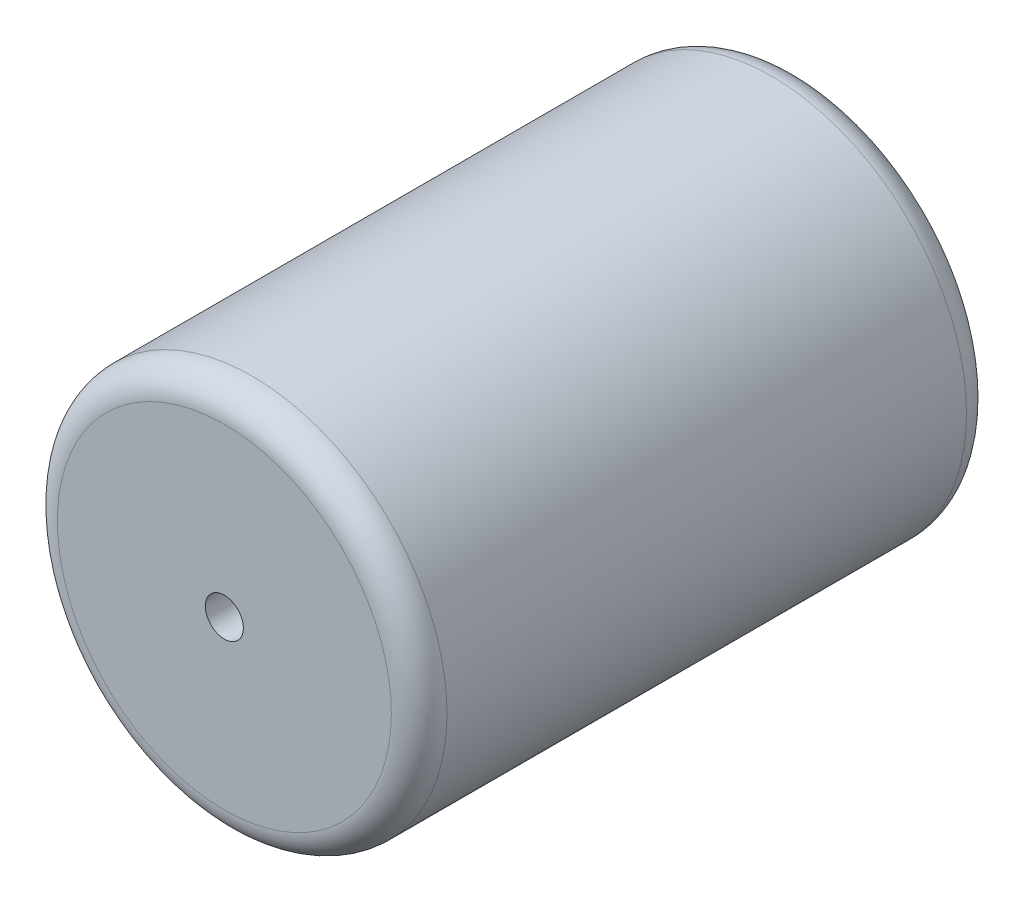
ISO-10303-21;
HEADER;
FILE_DESCRIPTION(('STEP AP214'),'2;1');
FILE_NAME('part.step','',(''),(''),'','','');
FILE_SCHEMA(('AUTOMOTIVE_DESIGN { 1 0 10303 214 1 1 1 1 }'));
ENDSEC;
DATA;
#1=APPLICATION_CONTEXT('core data for automotive mechanical design processes');
#2=APPLICATION_PROTOCOL_DEFINITION('international standard','automotive_design',2000,#1);
#3=PRODUCT_CONTEXT('',#1,'mechanical');
#4=PRODUCT('Part','Part','',(#3));
#5=PRODUCT_RELATED_PRODUCT_CATEGORY('part','',(#4));
#6=PRODUCT_DEFINITION_FORMATION('','',#4);
#7=PRODUCT_DEFINITION_CONTEXT('part definition',#1,'design');
#8=PRODUCT_DEFINITION('design','',#6,#7);
#9=PRODUCT_DEFINITION_SHAPE('','',#8);
#10=(LENGTH_UNIT() NAMED_UNIT(*) SI_UNIT(.MILLI.,.METRE.));
#11=(NAMED_UNIT(*) PLANE_ANGLE_UNIT() SI_UNIT($,.RADIAN.));
#12=(NAMED_UNIT(*) SI_UNIT($,.STERADIAN.) SOLID_ANGLE_UNIT());
#13=UNCERTAINTY_MEASURE_WITH_UNIT(LENGTH_MEASURE(1.E-05),#10,'distance_accuracy_value','');
#14=(GEOMETRIC_REPRESENTATION_CONTEXT(3) GLOBAL_UNCERTAINTY_ASSIGNED_CONTEXT((#13)) GLOBAL_UNIT_ASSIGNED_CONTEXT((#10,
#11,#12)) REPRESENTATION_CONTEXT('',''));
#15=CARTESIAN_POINT('',(0.,0.,0.));
#16=DIRECTION('',(0.,0.,1.));
#17=DIRECTION('',(1.,0.,0.));
#18=AXIS2_PLACEMENT_3D('',#15,#16,#17);
#19=CARTESIAN_POINT('',(0.,0.,31.));
#20=DIRECTION('',(0.,0.,-1.));
#21=DIRECTION('',(-1.,0.,0.));
#22=AXIS2_PLACEMENT_3D('',#19,#20,#21);
#23=CYLINDRICAL_SURFACE('',#22,10.5);
#24=CARTESIAN_POINT('',(0.,0.,1.5));
#25=DIRECTION('',(0.,0.,1.));
#26=DIRECTION('',(1.,0.,0.));
#27=AXIS2_PLACEMENT_3D('',#24,#25,#26);
#28=CIRCLE('',#27,10.5);
#29=CARTESIAN_POINT('',(10.5,0.,1.5));
#30=VERTEX_POINT('',#29);
#31=EDGE_CURVE('E43',#30,#30,#28,.T.);
#32=ORIENTED_EDGE('',*,*,#31,.T.);
#33=EDGE_LOOP('',(#32));
#34=FACE_BOUND('',#33,.T.);
#35=CARTESIAN_POINT('',(0.,0.,29.5));
#36=DIRECTION('',(0.,0.,1.));
#37=DIRECTION('',(1.,0.,0.));
#38=AXIS2_PLACEMENT_3D('',#35,#36,#37);
#39=CIRCLE('',#38,10.5);
#40=CARTESIAN_POINT('',(10.5,0.,29.5));
#41=VERTEX_POINT('',#40);
#42=EDGE_CURVE('E47',#41,#41,#39,.F.);
#43=ORIENTED_EDGE('',*,*,#42,.T.);
#44=EDGE_LOOP('',(#43));
#45=FACE_BOUND('',#44,.T.);
#46=ADVANCED_FACE('F32',(#34,#45),#23,.T.);
#47=CARTESIAN_POINT('',(0.,0.,31.));
#48=DIRECTION('',(0.,0.,1.));
#49=DIRECTION('',(1.,0.,0.));
#50=AXIS2_PLACEMENT_3D('',#47,#48,#49);
#51=PLANE('',#50);
#52=CARTESIAN_POINT('',(0.,0.,31.));
#53=DIRECTION('',(0.,0.,1.));
#54=DIRECTION('',(1.,0.,0.));
#55=AXIS2_PLACEMENT_3D('',#52,#53,#54);
#56=CIRCLE('',#55,1.025);
#57=CARTESIAN_POINT('',(1.025,0.,31.));
#58=VERTEX_POINT('',#57);
#59=EDGE_CURVE('E52',#58,#58,#56,.T.);
#60=ORIENTED_EDGE('',*,*,#59,.F.);
#61=EDGE_LOOP('',(#60));
#62=FACE_BOUND('',#61,.T.);
#63=CARTESIAN_POINT('',(0.,0.,31.));
#64=DIRECTION('',(0.,0.,1.));
#65=DIRECTION('',(1.,0.,0.));
#66=AXIS2_PLACEMENT_3D('',#63,#64,#65);
#67=CIRCLE('',#66,9.);
#68=CARTESIAN_POINT('',(9.,0.,31.));
#69=VERTEX_POINT('',#68);
#70=EDGE_CURVE('E10',#69,#69,#67,.T.);
#71=ORIENTED_EDGE('',*,*,#70,.T.);
#72=EDGE_LOOP('',(#71));
#73=FACE_BOUND('',#72,.T.);
#74=ADVANCED_FACE('F64',(#62,#73),#51,.T.);
#75=CARTESIAN_POINT('',(0.,0.,0.));
#76=DIRECTION('',(0.,0.,1.));
#77=DIRECTION('',(1.,0.,0.));
#78=AXIS2_PLACEMENT_3D('',#75,#76,#77);
#79=PLANE('',#78);
#80=CARTESIAN_POINT('',(0.,0.,0.));
#81=DIRECTION('',(0.,0.,-1.));
#82=DIRECTION('',(-1.,0.,0.));
#83=AXIS2_PLACEMENT_3D('',#80,#81,#82);
#84=CIRCLE('',#83,1.025);
#85=CARTESIAN_POINT('',(-1.025,0.,0.));
#86=VERTEX_POINT('',#85);
#87=EDGE_CURVE('E55',#86,#86,#84,.T.);
#88=ORIENTED_EDGE('',*,*,#87,.F.);
#89=EDGE_LOOP('',(#88));
#90=FACE_BOUND('',#89,.T.);
#91=CARTESIAN_POINT('',(0.,0.,0.));
#92=DIRECTION('',(0.,0.,1.));
#93=DIRECTION('',(1.,0.,0.));
#94=AXIS2_PLACEMENT_3D('',#91,#92,#93);
#95=CIRCLE('',#94,9.);
#96=CARTESIAN_POINT('',(9.,0.,0.));
#97=VERTEX_POINT('',#96);
#98=EDGE_CURVE('E39',#97,#97,#95,.F.);
#99=ORIENTED_EDGE('',*,*,#98,.T.);
#100=EDGE_LOOP('',(#99));
#101=FACE_BOUND('',#100,.T.);
#102=ADVANCED_FACE('F61',(#90,#101),#79,.F.);
#103=CARTESIAN_POINT('',(0.,0.,1.5));
#104=DIRECTION('',(0.,0.,1.));
#105=DIRECTION('',(1.,0.,0.));
#106=AXIS2_PLACEMENT_3D('',#103,#104,#105);
#107=TOROIDAL_SURFACE('',#106,9.,1.5);
#108=ORIENTED_EDGE('',*,*,#98,.F.);
#109=EDGE_LOOP('',(#108));
#110=FACE_BOUND('',#109,.T.);
#111=ORIENTED_EDGE('',*,*,#31,.F.);
#112=EDGE_LOOP('',(#111));
#113=FACE_BOUND('',#112,.T.);
#114=ADVANCED_FACE('F63',(#110,#113),#107,.T.);
#115=CARTESIAN_POINT('',(0.,0.,29.5));
#116=DIRECTION('',(0.,0.,1.));
#117=DIRECTION('',(1.,0.,0.));
#118=AXIS2_PLACEMENT_3D('',#115,#116,#117);
#119=TOROIDAL_SURFACE('',#118,9.,1.5);
#120=ORIENTED_EDGE('',*,*,#42,.F.);
#121=EDGE_LOOP('',(#120));
#122=FACE_BOUND('',#121,.T.);
#123=ORIENTED_EDGE('',*,*,#70,.F.);
#124=EDGE_LOOP('',(#123));
#125=FACE_BOUND('',#124,.T.);
#126=ADVANCED_FACE('F34',(#122,#125),#119,.T.);
#127=CARTESIAN_POINT('',(0.,0.,35.));
#128=DIRECTION('',(0.,0.,-1.));
#129=DIRECTION('',(-1.,0.,0.));
#130=AXIS2_PLACEMENT_3D('',#127,#128,#129);
#131=CYLINDRICAL_SURFACE('',#130,1.025);
#132=ORIENTED_EDGE('',*,*,#59,.T.);
#133=EDGE_LOOP('',(#132));
#134=FACE_BOUND('',#133,.T.);
#135=ORIENTED_EDGE('',*,*,#87,.T.);
#136=EDGE_LOOP('',(#135));
#137=FACE_BOUND('',#136,.T.);
#138=ADVANCED_FACE('F59',(#134,#137),#131,.F.);
#139=CLOSED_SHELL('',(#46,#74,#102,#114,#126,#138));
#140=MANIFOLD_SOLID_BREP('B2',#139);
#141=ADVANCED_BREP_SHAPE_REPRESENTATION('',(#18,#140),#14);
#142=SHAPE_DEFINITION_REPRESENTATION(#9,#141);
ENDSEC;
END-ISO-10303-21;
